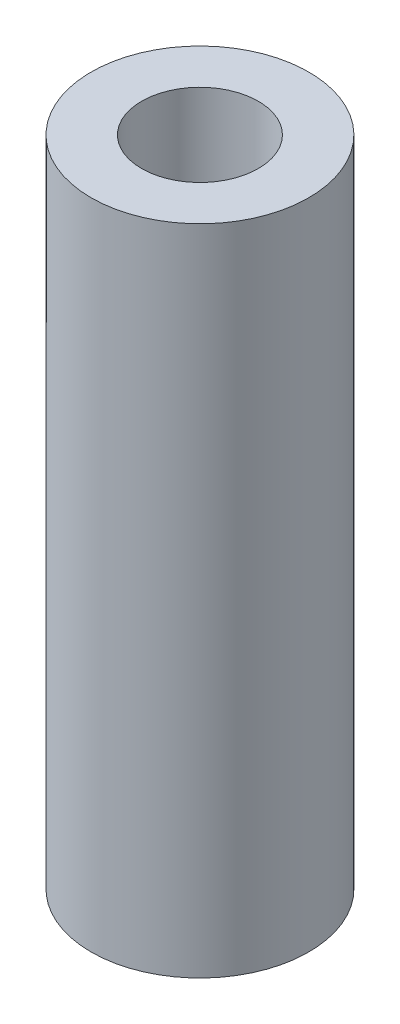
ISO-10303-21;
HEADER;
FILE_DESCRIPTION(('STEP AP214'),'2;1');
FILE_NAME('part.step','',(''),(''),'','','');
FILE_SCHEMA(('AUTOMOTIVE_DESIGN { 1 0 10303 214 1 1 1 1 }'));
ENDSEC;
DATA;
#1=APPLICATION_CONTEXT('core data for automotive mechanical design processes');
#2=APPLICATION_PROTOCOL_DEFINITION('international standard','automotive_design',2000,#1);
#3=PRODUCT_CONTEXT('',#1,'mechanical');
#4=PRODUCT('Part','Part','',(#3));
#5=PRODUCT_RELATED_PRODUCT_CATEGORY('part','',(#4));
#6=PRODUCT_DEFINITION_FORMATION('','',#4);
#7=PRODUCT_DEFINITION_CONTEXT('part definition',#1,'design');
#8=PRODUCT_DEFINITION('design','',#6,#7);
#9=PRODUCT_DEFINITION_SHAPE('','',#8);
#10=(LENGTH_UNIT() NAMED_UNIT(*) SI_UNIT(.MILLI.,.METRE.));
#11=(NAMED_UNIT(*) PLANE_ANGLE_UNIT() SI_UNIT($,.RADIAN.));
#12=(NAMED_UNIT(*) SI_UNIT($,.STERADIAN.) SOLID_ANGLE_UNIT());
#13=UNCERTAINTY_MEASURE_WITH_UNIT(LENGTH_MEASURE(1.E-05),#10,'distance_accuracy_value','');
#14=(GEOMETRIC_REPRESENTATION_CONTEXT(3) GLOBAL_UNCERTAINTY_ASSIGNED_CONTEXT((#13)) GLOBAL_UNIT_ASSIGNED_CONTEXT((#10,
#11,#12)) REPRESENTATION_CONTEXT('',''));
#15=CARTESIAN_POINT('',(0.,0.,0.));
#16=DIRECTION('',(0.,0.,1.));
#17=DIRECTION('',(1.,0.,0.));
#18=AXIS2_PLACEMENT_3D('',#15,#16,#17);
#19=CARTESIAN_POINT('',(0.,14.2875,0.));
#20=DIRECTION('',(0.,1.,0.));
#21=DIRECTION('',(0.,0.,1.));
#22=AXIS2_PLACEMENT_3D('',#19,#20,#21);
#23=PLANE('',#22);
#24=CARTESIAN_POINT('',(0.,14.2875,0.));
#25=DIRECTION('',(0.,1.,0.));
#26=DIRECTION('',(0.,0.,1.));
#27=AXIS2_PLACEMENT_3D('',#24,#25,#26);
#28=CIRCLE('',#27,4.7625);
#29=CARTESIAN_POINT('',(0.,14.2875,4.7625));
#30=VERTEX_POINT('',#29);
#31=EDGE_CURVE('E10',#30,#30,#28,.T.);
#32=ORIENTED_EDGE('',*,*,#31,.T.);
#33=EDGE_LOOP('',(#32));
#34=FACE_BOUND('',#33,.T.);
#35=CARTESIAN_POINT('',(0.,14.2875,0.));
#36=DIRECTION('',(0.,1.,0.));
#37=DIRECTION('',(0.,0.,1.));
#38=AXIS2_PLACEMENT_3D('',#35,#36,#37);
#39=CIRCLE('',#38,2.5527);
#40=CARTESIAN_POINT('',(0.,14.2875,2.5527));
#41=VERTEX_POINT('',#40);
#42=EDGE_CURVE('E48',#41,#41,#39,.T.);
#43=ORIENTED_EDGE('',*,*,#42,.F.);
#44=EDGE_LOOP('',(#43));
#45=FACE_BOUND('',#44,.T.);
#46=ADVANCED_FACE('F37',(#34,#45),#23,.T.);
#47=CARTESIAN_POINT('',(0.,-14.2875,0.));
#48=DIRECTION('',(0.,1.,0.));
#49=DIRECTION('',(0.,0.,1.));
#50=AXIS2_PLACEMENT_3D('',#47,#48,#49);
#51=PLANE('',#50);
#52=CARTESIAN_POINT('',(0.,-14.2875,0.));
#53=DIRECTION('',(0.,1.,0.));
#54=DIRECTION('',(0.,0.,1.));
#55=AXIS2_PLACEMENT_3D('',#52,#53,#54);
#56=CIRCLE('',#55,4.7625);
#57=CARTESIAN_POINT('',(0.,-14.2875,4.7625));
#58=VERTEX_POINT('',#57);
#59=EDGE_CURVE('E41',#58,#58,#56,.T.);
#60=ORIENTED_EDGE('',*,*,#59,.F.);
#61=EDGE_LOOP('',(#60));
#62=FACE_BOUND('',#61,.T.);
#63=CARTESIAN_POINT('',(0.,-14.2875,0.));
#64=DIRECTION('',(0.,1.,0.));
#65=DIRECTION('',(0.,0.,1.));
#66=AXIS2_PLACEMENT_3D('',#63,#64,#65);
#67=CIRCLE('',#66,2.5527);
#68=CARTESIAN_POINT('',(0.,-14.2875,2.5527));
#69=VERTEX_POINT('',#68);
#70=EDGE_CURVE('E50',#69,#69,#67,.T.);
#71=ORIENTED_EDGE('',*,*,#70,.T.);
#72=EDGE_LOOP('',(#71));
#73=FACE_BOUND('',#72,.T.);
#74=ADVANCED_FACE('F60',(#62,#73),#51,.F.);
#75=CARTESIAN_POINT('',(0.,14.2875,0.));
#76=DIRECTION('',(0.,-1.,0.));
#77=DIRECTION('',(0.,0.,-1.));
#78=AXIS2_PLACEMENT_3D('',#75,#76,#77);
#79=CYLINDRICAL_SURFACE('',#78,4.7625);
#80=ORIENTED_EDGE('',*,*,#31,.F.);
#81=EDGE_LOOP('',(#80));
#82=FACE_BOUND('',#81,.T.);
#83=ORIENTED_EDGE('',*,*,#59,.T.);
#84=EDGE_LOOP('',(#83));
#85=FACE_BOUND('',#84,.T.);
#86=ADVANCED_FACE('F39',(#82,#85),#79,.T.);
#87=CARTESIAN_POINT('',(0.,14.2875,0.));
#88=DIRECTION('',(0.,-1.,0.));
#89=DIRECTION('',(0.,0.,-1.));
#90=AXIS2_PLACEMENT_3D('',#87,#88,#89);
#91=CYLINDRICAL_SURFACE('',#90,2.5527);
#92=ORIENTED_EDGE('',*,*,#42,.T.);
#93=EDGE_LOOP('',(#92));
#94=FACE_BOUND('',#93,.T.);
#95=ORIENTED_EDGE('',*,*,#70,.F.);
#96=EDGE_LOOP('',(#95));
#97=FACE_BOUND('',#96,.T.);
#98=ADVANCED_FACE('F56',(#94,#97),#91,.F.);
#99=CLOSED_SHELL('',(#46,#74,#86,#98));
#100=MANIFOLD_SOLID_BREP('B2',#99);
#101=ADVANCED_BREP_SHAPE_REPRESENTATION('',(#18,#100),#14);
#102=SHAPE_DEFINITION_REPRESENTATION(#9,#101);
ENDSEC;
END-ISO-10303-21;
